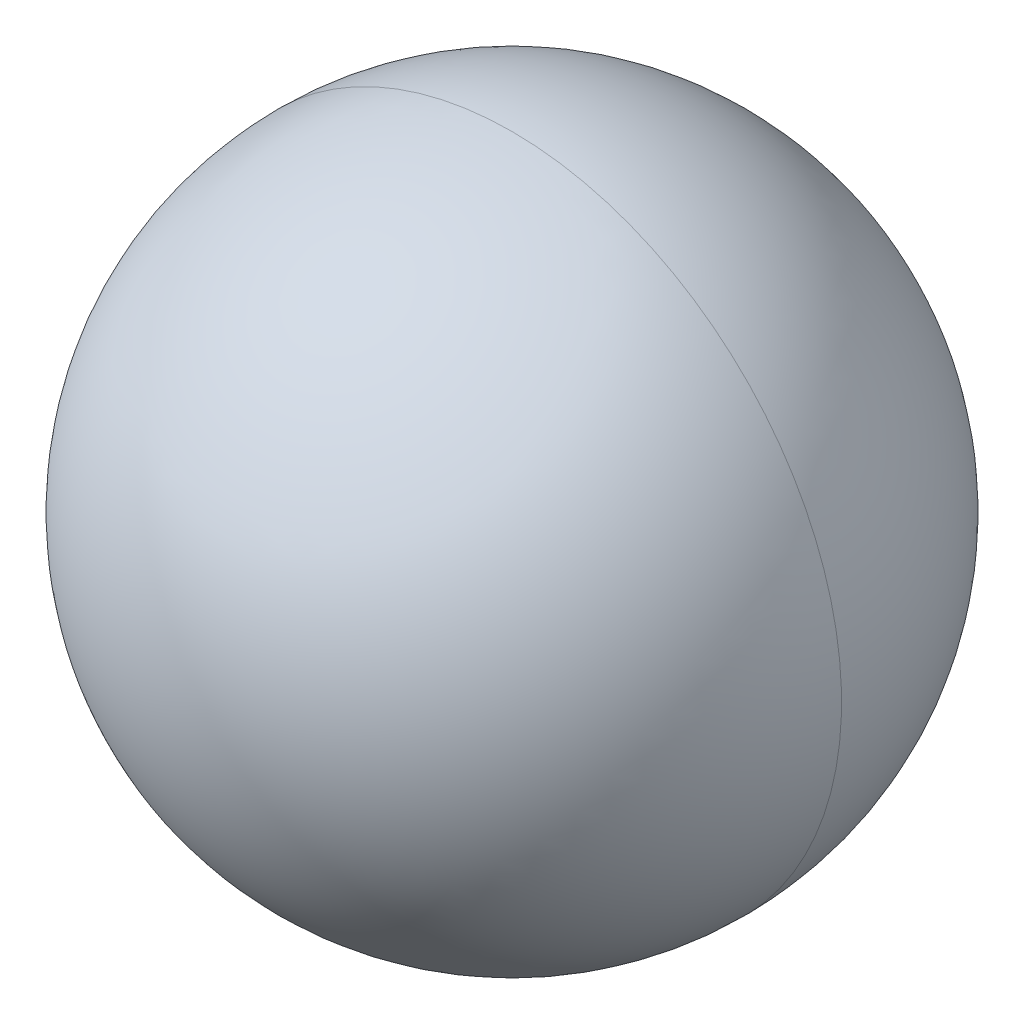
ISO-10303-21;
HEADER;
FILE_DESCRIPTION(('STEP AP214'),'2;1');
FILE_NAME('part.step','',(''),(''),'','','');
FILE_SCHEMA(('AUTOMOTIVE_DESIGN { 1 0 10303 214 1 1 1 1 }'));
ENDSEC;
DATA;
#1=APPLICATION_CONTEXT('core data for automotive mechanical design processes');
#2=APPLICATION_PROTOCOL_DEFINITION('international standard','automotive_design',2000,#1);
#3=PRODUCT_CONTEXT('',#1,'mechanical');
#4=PRODUCT('Part','Part','',(#3));
#5=PRODUCT_RELATED_PRODUCT_CATEGORY('part','',(#4));
#6=PRODUCT_DEFINITION_FORMATION('','',#4);
#7=PRODUCT_DEFINITION_CONTEXT('part definition',#1,'design');
#8=PRODUCT_DEFINITION('design','',#6,#7);
#9=PRODUCT_DEFINITION_SHAPE('','',#8);
#10=(LENGTH_UNIT() NAMED_UNIT(*) SI_UNIT(.MILLI.,.METRE.));
#11=(NAMED_UNIT(*) PLANE_ANGLE_UNIT() SI_UNIT($,.RADIAN.));
#12=(NAMED_UNIT(*) SI_UNIT($,.STERADIAN.) SOLID_ANGLE_UNIT());
#13=UNCERTAINTY_MEASURE_WITH_UNIT(LENGTH_MEASURE(1.E-05),#10,'distance_accuracy_value','');
#14=(GEOMETRIC_REPRESENTATION_CONTEXT(3) GLOBAL_UNCERTAINTY_ASSIGNED_CONTEXT((#13)) GLOBAL_UNIT_ASSIGNED_CONTEXT((#10,
#11,#12)) REPRESENTATION_CONTEXT('',''));
#15=CARTESIAN_POINT('',(0.,0.,0.));
#16=DIRECTION('',(0.,0.,1.));
#17=DIRECTION('',(1.,0.,0.));
#18=AXIS2_PLACEMENT_3D('',#15,#16,#17);
#19=CARTESIAN_POINT('',(0.,0.,0.));
#20=DIRECTION('',(0.,0.,1.));
#21=DIRECTION('',(-1.,0.,0.));
#22=AXIS2_PLACEMENT_3D('',#19,#20,#21);
#23=SPHERICAL_SURFACE('',#22,1.19);
#24=CARTESIAN_POINT('',(0.,0.,0.));
#25=DIRECTION('',(0.,0.,1.));
#26=DIRECTION('',(1.,0.,0.));
#27=AXIS2_PLACEMENT_3D('',#24,#25,#26);
#28=CIRCLE('',#27,1.19);
#29=CARTESIAN_POINT('',(0.,-1.19,0.));
#30=VERTEX_POINT('',#29);
#31=CARTESIAN_POINT('',(0.,1.19,0.));
#32=VERTEX_POINT('',#31);
#33=EDGE_CURVE('E11',#30,#32,#28,.T.);
#34=ORIENTED_EDGE('',*,*,#33,.F.);
#35=CARTESIAN_POINT('',(0.,0.,0.));
#36=DIRECTION('',(0.,0.,-1.));
#37=DIRECTION('',(-1.,0.,0.));
#38=AXIS2_PLACEMENT_3D('',#35,#36,#37);
#39=CIRCLE('',#38,1.19);
#40=EDGE_CURVE('E20',#30,#32,#39,.T.);
#41=ORIENTED_EDGE('',*,*,#40,.T.);
#42=EDGE_LOOP('',(#34,#41));
#43=FACE_BOUND('',#42,.T.);
#44=ADVANCED_FACE('F16',(#43),#23,.T.);
#45=CARTESIAN_POINT('',(0.,0.,0.));
#46=DIRECTION('',(0.,0.,1.));
#47=DIRECTION('',(-1.,0.,0.));
#48=AXIS2_PLACEMENT_3D('',#45,#46,#47);
#49=SPHERICAL_SURFACE('',#48,1.19);
#50=ORIENTED_EDGE('',*,*,#40,.F.);
#51=ORIENTED_EDGE('',*,*,#33,.T.);
#52=EDGE_LOOP('',(#50,#51));
#53=FACE_BOUND('',#52,.T.);
#54=ADVANCED_FACE('F18',(#53),#49,.T.);
#55=CLOSED_SHELL('',(#44,#54));
#56=MANIFOLD_SOLID_BREP('B1',#55);
#57=ADVANCED_BREP_SHAPE_REPRESENTATION('',(#18,#56),#14);
#58=SHAPE_DEFINITION_REPRESENTATION(#9,#57);
ENDSEC;
END-ISO-10303-21;
